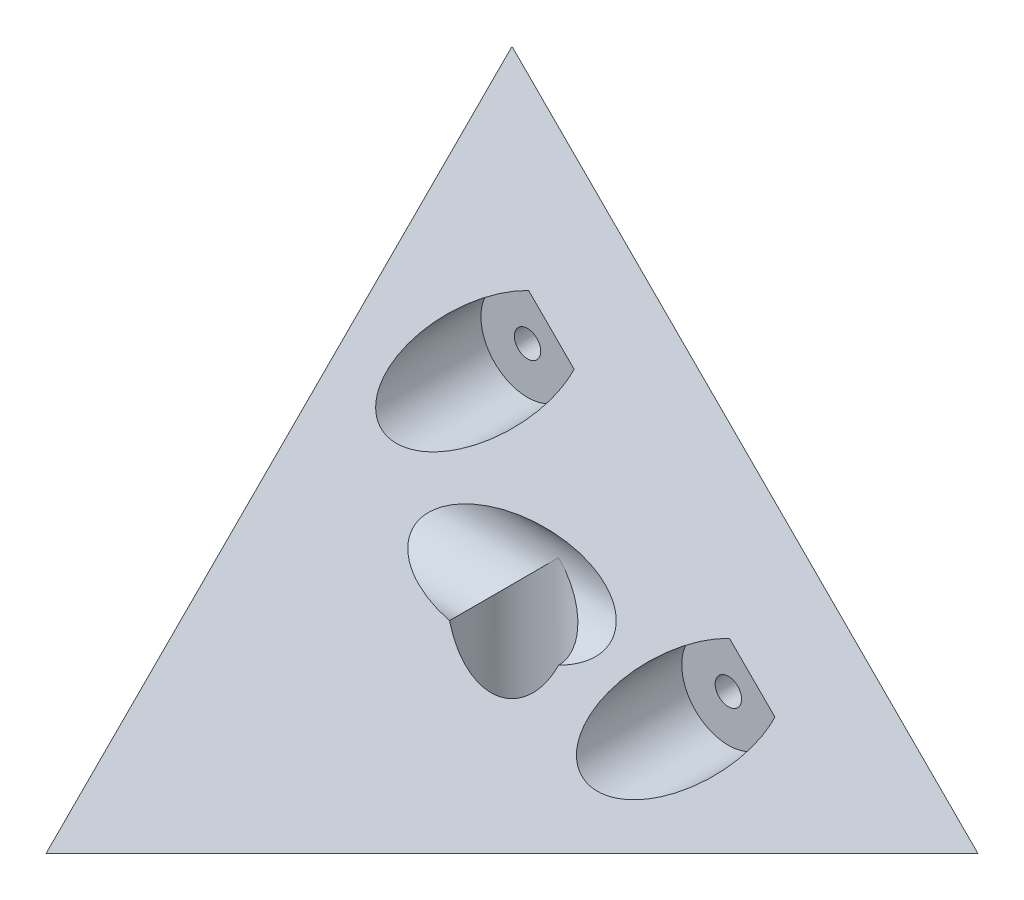
ISO-10303-21;
HEADER;
FILE_DESCRIPTION(('STEP AP214'),'2;1');
FILE_NAME('part.step','',(''),(''),'','','');
FILE_SCHEMA(('AUTOMOTIVE_DESIGN { 1 0 10303 214 1 1 1 1 }'));
ENDSEC;
DATA;
#1=APPLICATION_CONTEXT('core data for automotive mechanical design processes');
#2=APPLICATION_PROTOCOL_DEFINITION('international standard','automotive_design',2000,#1);
#3=PRODUCT_CONTEXT('',#1,'mechanical');
#4=PRODUCT('Part','Part','',(#3));
#5=PRODUCT_RELATED_PRODUCT_CATEGORY('part','',(#4));
#6=PRODUCT_DEFINITION_FORMATION('','',#4);
#7=PRODUCT_DEFINITION_CONTEXT('part definition',#1,'design');
#8=PRODUCT_DEFINITION('design','',#6,#7);
#9=PRODUCT_DEFINITION_SHAPE('','',#8);
#10=(LENGTH_UNIT() NAMED_UNIT(*) SI_UNIT(.MILLI.,.METRE.));
#11=(NAMED_UNIT(*) PLANE_ANGLE_UNIT() SI_UNIT($,.RADIAN.));
#12=(NAMED_UNIT(*) SI_UNIT($,.STERADIAN.) SOLID_ANGLE_UNIT());
#13=UNCERTAINTY_MEASURE_WITH_UNIT(LENGTH_MEASURE(1.E-05),#10,'distance_accuracy_value','');
#14=(GEOMETRIC_REPRESENTATION_CONTEXT(3) GLOBAL_UNCERTAINTY_ASSIGNED_CONTEXT((#13)) GLOBAL_UNIT_ASSIGNED_CONTEXT((#10,
#11,#12)) REPRESENTATION_CONTEXT('',''));
#15=CARTESIAN_POINT('',(0.,0.,0.));
#16=DIRECTION('',(0.,0.,1.));
#17=DIRECTION('',(1.,0.,0.));
#18=AXIS2_PLACEMENT_3D('',#15,#16,#17);
#19=CARTESIAN_POINT('',(0.,0.,0.));
#20=DIRECTION('',(0.,0.,-1.));
#21=DIRECTION('',(-1.,0.,0.));
#22=AXIS2_PLACEMENT_3D('',#19,#20,#21);
#23=PLANE('',#22);
#24=CARTESIAN_POINT('',(5.,17.9289321881345,0.));
#25=DIRECTION('',(0.,0.,1.));
#26=DIRECTION('',(1.,0.,0.));
#27=AXIS2_PLACEMENT_3D('',#24,#25,#26);
#28=CIRCLE('',#27,0.85);
#29=CARTESIAN_POINT('',(5.85,17.9289321881345,0.));
#30=VERTEX_POINT('',#29);
#31=EDGE_CURVE('E135',#30,#30,#28,.T.);
#32=ORIENTED_EDGE('',*,*,#31,.T.);
#33=EDGE_LOOP('',(#32));
#34=FACE_BOUND('',#33,.T.);
#35=DIRECTION('',(0.,-1.,0.));
#36=VECTOR('',#35,1.);
#37=CARTESIAN_POINT('',(0.,0.,0.));
#38=LINE('',#37,#36);
#39=CARTESIAN_POINT('',(0.,30.,0.));
#40=VERTEX_POINT('',#39);
#41=CARTESIAN_POINT('',(0.,0.,0.));
#42=VERTEX_POINT('',#41);
#43=EDGE_CURVE('E139',#40,#42,#38,.T.);
#44=ORIENTED_EDGE('',*,*,#43,.F.);
#45=DIRECTION('',(-0.707106781186548,0.707106781186548,0.));
#46=VECTOR('',#45,1.);
#47=CARTESIAN_POINT('',(15.,15.,0.));
#48=LINE('',#47,#46);
#49=CARTESIAN_POINT('',(30.,0.,0.));
#50=VERTEX_POINT('',#49);
#51=EDGE_CURVE('E41',#40,#50,#48,.F.);
#52=ORIENTED_EDGE('',*,*,#51,.T.);
#53=DIRECTION('',(1.,0.,0.));
#54=VECTOR('',#53,1.);
#55=CARTESIAN_POINT('',(0.,0.,0.));
#56=LINE('',#55,#54);
#57=EDGE_CURVE('E142',#42,#50,#56,.T.);
#58=ORIENTED_EDGE('',*,*,#57,.F.);
#59=EDGE_LOOP('',(#44,#52,#58));
#60=FACE_BOUND('',#59,.T.);
#61=CARTESIAN_POINT('',(17.9289321881345,5.,0.));
#62=DIRECTION('',(0.,0.,1.));
#63=DIRECTION('',(1.,0.,0.));
#64=AXIS2_PLACEMENT_3D('',#61,#62,#63);
#65=CIRCLE('',#64,0.85);
#66=CARTESIAN_POINT('',(18.7789321881345,5.,0.));
#67=VERTEX_POINT('',#66);
#68=EDGE_CURVE('E132',#67,#67,#65,.T.);
#69=ORIENTED_EDGE('',*,*,#68,.T.);
#70=EDGE_LOOP('',(#69));
#71=FACE_BOUND('',#70,.T.);
#72=DIRECTION('',(-1.,0.,0.));
#73=VECTOR('',#72,1.);
#74=CARTESIAN_POINT('',(11.,2.5,0.));
#75=LINE('',#74,#73);
#76=CARTESIAN_POINT('',(11.,2.5,0.));
#77=VERTEX_POINT('',#76);
#78=CARTESIAN_POINT('',(5.,2.5,0.));
#79=VERTEX_POINT('',#78);
#80=EDGE_CURVE('E81',#77,#79,#75,.T.);
#81=ORIENTED_EDGE('',*,*,#80,.F.);
#82=CARTESIAN_POINT('',(11.,5.,0.));
#83=DIRECTION('',(0.,0.,-1.));
#84=DIRECTION('',(-1.,0.,0.));
#85=AXIS2_PLACEMENT_3D('',#82,#83,#84);
#86=CIRCLE('',#85,2.5);
#87=CARTESIAN_POINT('',(11.,7.5,0.));
#88=VERTEX_POINT('',#87);
#89=EDGE_CURVE('E161',#88,#77,#86,.T.);
#90=ORIENTED_EDGE('',*,*,#89,.F.);
#91=DIRECTION('',(1.,0.,0.));
#92=VECTOR('',#91,1.);
#93=CARTESIAN_POINT('',(11.,7.5,0.));
#94=LINE('',#93,#92);
#95=CARTESIAN_POINT('',(5.,7.5,0.));
#96=VERTEX_POINT('',#95);
#97=EDGE_CURVE('E169',#96,#88,#94,.T.);
#98=ORIENTED_EDGE('',*,*,#97,.F.);
#99=CARTESIAN_POINT('',(5.,5.,0.));
#100=DIRECTION('',(0.,0.,-1.));
#101=DIRECTION('',(-1.,0.,0.));
#102=AXIS2_PLACEMENT_3D('',#99,#100,#101);
#103=CIRCLE('',#102,2.5);
#104=EDGE_CURVE('E163',#79,#96,#103,.T.);
#105=ORIENTED_EDGE('',*,*,#104,.F.);
#106=EDGE_LOOP('',(#81,#90,#98,#105));
#107=FACE_BOUND('',#106,.T.);
#108=ADVANCED_FACE('F32',(#34,#60,#71,#107),#23,.T.);
#109=CARTESIAN_POINT('',(0.,0.,30.));
#110=DIRECTION('',(1.,0.,0.));
#111=DIRECTION('',(0.,0.,-1.));
#112=AXIS2_PLACEMENT_3D('',#109,#110,#111);
#113=PLANE('',#112);
#114=CARTESIAN_POINT('',(0.,10.,10.));
#115=DIRECTION('',(-1.,0.,0.));
#116=DIRECTION('',(0.,0.,1.));
#117=AXIS2_PLACEMENT_3D('',#114,#115,#116);
#118=CIRCLE('',#117,3.);
#119=CARTESIAN_POINT('',(0.,10.,13.));
#120=VERTEX_POINT('',#119);
#121=EDGE_CURVE('E120',#120,#120,#118,.T.);
#122=ORIENTED_EDGE('',*,*,#121,.F.);
#123=EDGE_LOOP('',(#122));
#124=FACE_BOUND('',#123,.T.);
#125=DIRECTION('',(0.,0.,-1.));
#126=VECTOR('',#125,1.);
#127=CARTESIAN_POINT('',(0.,0.,30.));
#128=LINE('',#127,#126);
#129=CARTESIAN_POINT('',(0.,0.,30.));
#130=VERTEX_POINT('',#129);
#131=EDGE_CURVE('E145',#130,#42,#128,.T.);
#132=ORIENTED_EDGE('',*,*,#131,.F.);
#133=DIRECTION('',(0.,-0.707106781186546,0.707106781186549));
#134=VECTOR('',#133,1.);
#135=CARTESIAN_POINT('',(0.,0.,30.));
#136=LINE('',#135,#134);
#137=EDGE_CURVE('E11',#130,#40,#136,.F.);
#138=ORIENTED_EDGE('',*,*,#137,.T.);
#139=ORIENTED_EDGE('',*,*,#43,.T.);
#140=EDGE_LOOP('',(#132,#138,#139));
#141=FACE_BOUND('',#140,.T.);
#142=ADVANCED_FACE('F211',(#124,#141),#113,.F.);
#143=CARTESIAN_POINT('',(0.,0.,30.));
#144=DIRECTION('',(0.,1.,0.));
#145=DIRECTION('',(0.,0.,1.));
#146=AXIS2_PLACEMENT_3D('',#143,#144,#145);
#147=PLANE('',#146);
#148=CARTESIAN_POINT('',(10.,0.,10.));
#149=DIRECTION('',(0.,-1.,0.));
#150=DIRECTION('',(0.,0.,-1.));
#151=AXIS2_PLACEMENT_3D('',#148,#149,#150);
#152=CIRCLE('',#151,3.);
#153=CARTESIAN_POINT('',(10.,0.,7.));
#154=VERTEX_POINT('',#153);
#155=EDGE_CURVE('E230',#154,#154,#152,.T.);
#156=ORIENTED_EDGE('',*,*,#155,.F.);
#157=EDGE_LOOP('',(#156));
#158=FACE_BOUND('',#157,.T.);
#159=ORIENTED_EDGE('',*,*,#57,.T.);
#160=DIRECTION('',(0.707106781186546,0.,-0.707106781186549));
#161=VECTOR('',#160,1.);
#162=CARTESIAN_POINT('',(0.,0.,30.));
#163=LINE('',#162,#161);
#164=EDGE_CURVE('E148',#50,#130,#163,.F.);
#165=ORIENTED_EDGE('',*,*,#164,.T.);
#166=ORIENTED_EDGE('',*,*,#131,.T.);
#167=EDGE_LOOP('',(#159,#165,#166));
#168=FACE_BOUND('',#167,.T.);
#169=ADVANCED_FACE('F217',(#158,#168),#147,.F.);
#170=CARTESIAN_POINT('',(5.,17.9289321881345,30.));
#171=DIRECTION('',(0.,0.,-1.));
#172=DIRECTION('',(-1.,0.,0.));
#173=AXIS2_PLACEMENT_3D('',#170,#171,#172);
#174=CYLINDRICAL_SURFACE('',#173,0.85);
#175=CARTESIAN_POINT('',(5.,17.9289321881345,4.));
#176=DIRECTION('',(0.,0.,-1.));
#177=DIRECTION('',(-1.,0.,0.));
#178=AXIS2_PLACEMENT_3D('',#175,#176,#177);
#179=CIRCLE('',#178,0.85);
#180=CARTESIAN_POINT('',(4.15,17.9289321881345,4.));
#181=VERTEX_POINT('',#180);
#182=EDGE_CURVE('E127',#181,#181,#179,.F.);
#183=ORIENTED_EDGE('',*,*,#182,.T.);
#184=EDGE_LOOP('',(#183));
#185=FACE_BOUND('',#184,.T.);
#186=ORIENTED_EDGE('',*,*,#31,.F.);
#187=EDGE_LOOP('',(#186));
#188=FACE_BOUND('',#187,.T.);
#189=ADVANCED_FACE('F184',(#185,#188),#174,.F.);
#190=CARTESIAN_POINT('',(17.9289321881345,5.,30.));
#191=DIRECTION('',(0.,0.,-1.));
#192=DIRECTION('',(-1.,0.,0.));
#193=AXIS2_PLACEMENT_3D('',#190,#191,#192);
#194=CYLINDRICAL_SURFACE('',#193,0.85);
#195=CARTESIAN_POINT('',(17.9289321881345,5.,4.));
#196=DIRECTION('',(0.,0.,-1.));
#197=DIRECTION('',(-1.,0.,0.));
#198=AXIS2_PLACEMENT_3D('',#195,#196,#197);
#199=CIRCLE('',#198,0.85);
#200=CARTESIAN_POINT('',(17.0789321881345,5.,4.));
#201=VERTEX_POINT('',#200);
#202=EDGE_CURVE('E115',#201,#201,#199,.F.);
#203=ORIENTED_EDGE('',*,*,#202,.T.);
#204=EDGE_LOOP('',(#203));
#205=FACE_BOUND('',#204,.T.);
#206=ORIENTED_EDGE('',*,*,#68,.F.);
#207=EDGE_LOOP('',(#206));
#208=FACE_BOUND('',#207,.T.);
#209=ADVANCED_FACE('F197',(#205,#208),#194,.F.);
#210=CARTESIAN_POINT('',(0.,0.,30.));
#211=DIRECTION('',(0.577350269189626,0.577350269189626,0.577350269189625));
#212=DIRECTION('',(-0.707106781186547,0.707106781186547,0.));
#213=AXIS2_PLACEMENT_3D('',#210,#211,#212);
#214=PLANE('',#213);
#215=CARTESIAN_POINT('',(10.,9.99999999999994,10.));
#216=DIRECTION('',(0.577350269189626,0.577350269189626,0.577350269189625));
#217=DIRECTION('',(0.408248290463864,-0.816496580927726,0.408248290463863));
#218=AXIS2_PLACEMENT_3D('',#215,#216,#217);
#219=ELLIPSE('',#218,5.19615242270663,3.);
#220=CARTESIAN_POINT('',(13.,7.,9.99999999999993));
#221=VERTEX_POINT('',#220);
#222=CARTESIAN_POINT('',(8.6583592135001,8.6583592135001,12.6832815729997));
#223=VERTEX_POINT('',#222);
#224=EDGE_CURVE('E242',#221,#223,#219,.F.);
#225=ORIENTED_EDGE('',*,*,#224,.T.);
#226=CARTESIAN_POINT('',(9.99999999999994,10.,10.));
#227=DIRECTION('',(0.577350269189626,0.577350269189626,0.577350269189625));
#228=DIRECTION('',(-0.816496580927726,0.408248290463864,0.408248290463863));
#229=AXIS2_PLACEMENT_3D('',#226,#227,#228);
#230=ELLIPSE('',#229,5.19615242270663,3.);
#231=EDGE_CURVE('E171',#223,#221,#230,.F.);
#232=ORIENTED_EDGE('',*,*,#231,.T.);
#233=EDGE_LOOP('',(#225,#232));
#234=FACE_BOUND('',#233,.T.);
#235=CARTESIAN_POINT('',(5.,17.9289321881345,7.07106781186541));
#236=DIRECTION('',(0.577350269189626,0.577350269189626,0.577350269189625));
#237=DIRECTION('',(0.408248290463862,0.408248290463862,-0.816496580927727));
#238=AXIS2_PLACEMENT_3D('',#235,#236,#237);
#239=ELLIPSE('',#238,5.19615242270664,3.);
#240=CARTESIAN_POINT('',(7.99913754890817,18.0008624510917,4.));
#241=VERTEX_POINT('',#240);
#242=CARTESIAN_POINT('',(5.07193026295723,20.9280697370427,4.));
#243=VERTEX_POINT('',#242);
#244=EDGE_CURVE('E124',#241,#243,#239,.F.);
#245=ORIENTED_EDGE('',*,*,#244,.T.);
#246=DIRECTION('',(0.707106781186547,-0.707106781186547,0.));
#247=VECTOR('',#246,1.);
#248=CARTESIAN_POINT('',(6.5355339059327,19.4644660940672,4.));
#249=LINE('',#248,#247);
#250=EDGE_CURVE('E136',#243,#241,#249,.T.);
#251=ORIENTED_EDGE('',*,*,#250,.T.);
#252=EDGE_LOOP('',(#245,#251));
#253=FACE_BOUND('',#252,.T.);
#254=CARTESIAN_POINT('',(17.9289321881345,5.,7.07106781186541));
#255=DIRECTION('',(0.577350269189626,0.577350269189626,0.577350269189625));
#256=DIRECTION('',(0.408248290463862,0.408248290463862,-0.816496580927727));
#257=AXIS2_PLACEMENT_3D('',#254,#255,#256);
#258=ELLIPSE('',#257,5.19615242270664,3.);
#259=CARTESIAN_POINT('',(20.9280697370427,5.07193026295723,4.));
#260=VERTEX_POINT('',#259);
#261=CARTESIAN_POINT('',(18.0008624510918,7.99913754890817,4.));
#262=VERTEX_POINT('',#261);
#263=EDGE_CURVE('E117',#260,#262,#258,.F.);
#264=ORIENTED_EDGE('',*,*,#263,.T.);
#265=DIRECTION('',(0.707106781186547,-0.707106781186547,0.));
#266=VECTOR('',#265,1.);
#267=CARTESIAN_POINT('',(19.4644660940672,6.5355339059327,4.));
#268=LINE('',#267,#266);
#269=EDGE_CURVE('E112',#262,#260,#268,.T.);
#270=ORIENTED_EDGE('',*,*,#269,.T.);
#271=EDGE_LOOP('',(#264,#270));
#272=FACE_BOUND('',#271,.T.);
#273=ORIENTED_EDGE('',*,*,#51,.F.);
#274=ORIENTED_EDGE('',*,*,#137,.F.);
#275=ORIENTED_EDGE('',*,*,#164,.F.);
#276=EDGE_LOOP('',(#273,#274,#275));
#277=FACE_BOUND('',#276,.T.);
#278=ADVANCED_FACE('F122',(#234,#253,#272,#277),#214,.T.);
#279=CARTESIAN_POINT('',(17.9289321881345,5.,30.001));
#280=DIRECTION('',(0.,0.,-1.));
#281=DIRECTION('',(-1.,0.,0.));
#282=AXIS2_PLACEMENT_3D('',#279,#280,#281);
#283=CYLINDRICAL_SURFACE('',#282,3.);
#284=CARTESIAN_POINT('',(17.9289321881345,5.,4.));
#285=DIRECTION('',(0.,0.,-1.));
#286=DIRECTION('',(-1.,0.,0.));
#287=AXIS2_PLACEMENT_3D('',#284,#285,#286);
#288=CIRCLE('',#287,3.);
#289=EDGE_CURVE('E108',#260,#262,#288,.T.);
#290=ORIENTED_EDGE('',*,*,#289,.T.);
#291=ORIENTED_EDGE('',*,*,#263,.F.);
#292=EDGE_LOOP('',(#290,#291));
#293=FACE_BOUND('',#292,.T.);
#294=ADVANCED_FACE('F118',(#293),#283,.F.);
#295=CARTESIAN_POINT('',(17.9289321881345,5.,4.));
#296=DIRECTION('',(0.,0.,-1.));
#297=DIRECTION('',(-1.,0.,0.));
#298=AXIS2_PLACEMENT_3D('',#295,#296,#297);
#299=PLANE('',#298);
#300=ORIENTED_EDGE('',*,*,#202,.F.);
#301=EDGE_LOOP('',(#300));
#302=FACE_BOUND('',#301,.T.);
#303=ORIENTED_EDGE('',*,*,#289,.F.);
#304=ORIENTED_EDGE('',*,*,#269,.F.);
#305=EDGE_LOOP('',(#303,#304));
#306=FACE_BOUND('',#305,.T.);
#307=ADVANCED_FACE('F110',(#302,#306),#299,.F.);
#308=CARTESIAN_POINT('',(5.,17.9289321881345,30.001));
#309=DIRECTION('',(0.,0.,-1.));
#310=DIRECTION('',(-1.,0.,0.));
#311=AXIS2_PLACEMENT_3D('',#308,#309,#310);
#312=CYLINDRICAL_SURFACE('',#311,3.);
#313=CARTESIAN_POINT('',(5.,17.9289321881345,4.));
#314=DIRECTION('',(0.,0.,-1.));
#315=DIRECTION('',(-1.,0.,0.));
#316=AXIS2_PLACEMENT_3D('',#313,#314,#315);
#317=CIRCLE('',#316,3.);
#318=EDGE_CURVE('E176',#241,#243,#317,.T.);
#319=ORIENTED_EDGE('',*,*,#318,.T.);
#320=ORIENTED_EDGE('',*,*,#244,.F.);
#321=EDGE_LOOP('',(#319,#320));
#322=FACE_BOUND('',#321,.T.);
#323=ADVANCED_FACE('F191',(#322),#312,.F.);
#324=CARTESIAN_POINT('',(5.,17.9289321881345,4.));
#325=DIRECTION('',(0.,0.,-1.));
#326=DIRECTION('',(-1.,0.,0.));
#327=AXIS2_PLACEMENT_3D('',#324,#325,#326);
#328=PLANE('',#327);
#329=ORIENTED_EDGE('',*,*,#182,.F.);
#330=EDGE_LOOP('',(#329));
#331=FACE_BOUND('',#330,.T.);
#332=ORIENTED_EDGE('',*,*,#318,.F.);
#333=ORIENTED_EDGE('',*,*,#250,.F.);
#334=EDGE_LOOP('',(#332,#333));
#335=FACE_BOUND('',#334,.T.);
#336=ADVANCED_FACE('F187',(#331,#335),#328,.F.);
#337=CARTESIAN_POINT('',(30.001,10.,10.));
#338=DIRECTION('',(-1.,0.,0.));
#339=DIRECTION('',(0.,0.,1.));
#340=AXIS2_PLACEMENT_3D('',#337,#338,#339);
#341=CYLINDRICAL_SURFACE('',#340,3.);
#342=CARTESIAN_POINT('',(10.,10.,10.));
#343=DIRECTION('',(0.707106781186547,-0.707106781186547,0.));
#344=DIRECTION('',(-0.707106781186547,-0.707106781186547,0.));
#345=AXIS2_PLACEMENT_3D('',#342,#343,#344);
#346=ELLIPSE('',#345,4.24264068711929,3.);
#347=CARTESIAN_POINT('',(10.,10.,7.));
#348=VERTEX_POINT('',#347);
#349=EDGE_CURVE('E240',#348,#223,#346,.F.);
#350=ORIENTED_EDGE('',*,*,#349,.F.);
#351=CARTESIAN_POINT('',(10.,10.,10.));
#352=DIRECTION('',(-0.707106781186547,-0.707106781186547,0.));
#353=DIRECTION('',(0.707106781186547,-0.707106781186547,0.));
#354=AXIS2_PLACEMENT_3D('',#351,#352,#353);
#355=ELLIPSE('',#354,4.24264068711929,3.);
#356=EDGE_CURVE('E49',#221,#348,#355,.F.);
#357=ORIENTED_EDGE('',*,*,#356,.F.);
#358=ORIENTED_EDGE('',*,*,#231,.F.);
#359=EDGE_LOOP('',(#350,#357,#358));
#360=FACE_BOUND('',#359,.T.);
#361=ORIENTED_EDGE('',*,*,#121,.T.);
#362=EDGE_LOOP('',(#361));
#363=FACE_BOUND('',#362,.T.);
#364=ADVANCED_FACE('F190',(#360,#363),#341,.F.);
#365=CARTESIAN_POINT('',(5.,5.,0.));
#366=DIRECTION('',(0.,0.,-1.));
#367=DIRECTION('',(-1.,0.,0.));
#368=AXIS2_PLACEMENT_3D('',#365,#366,#367);
#369=SPHERICAL_SURFACE('',#368,2.5);
#370=CARTESIAN_POINT('',(5.,5.,0.));
#371=DIRECTION('',(1.,0.,0.));
#372=DIRECTION('',(0.,1.,0.));
#373=AXIS2_PLACEMENT_3D('',#370,#371,#372);
#374=CIRCLE('',#373,2.5);
#375=CARTESIAN_POINT('',(5.,5.,-2.5));
#376=VERTEX_POINT('',#375);
#377=EDGE_CURVE('E36',#79,#376,#374,.T.);
#378=ORIENTED_EDGE('',*,*,#377,.F.);
#379=ORIENTED_EDGE('',*,*,#104,.T.);
#380=CARTESIAN_POINT('',(5.,5.,0.));
#381=DIRECTION('',(1.,0.,0.));
#382=DIRECTION('',(0.,0.,-1.));
#383=AXIS2_PLACEMENT_3D('',#380,#381,#382);
#384=CIRCLE('',#383,2.5);
#385=EDGE_CURVE('E58',#376,#96,#384,.T.);
#386=ORIENTED_EDGE('',*,*,#385,.F.);
#387=EDGE_LOOP('',(#378,#379,#386));
#388=FACE_BOUND('',#387,.T.);
#389=ADVANCED_FACE('F34',(#388),#369,.T.);
#390=CARTESIAN_POINT('',(11.,5.,0.));
#391=DIRECTION('',(1.,0.,0.));
#392=DIRECTION('',(0.,1.,0.));
#393=AXIS2_PLACEMENT_3D('',#390,#391,#392);
#394=CYLINDRICAL_SURFACE('',#393,2.5);
#395=CARTESIAN_POINT('',(11.,5.,0.));
#396=DIRECTION('',(1.,0.,0.));
#397=DIRECTION('',(0.,0.,-1.));
#398=AXIS2_PLACEMENT_3D('',#395,#396,#397);
#399=CIRCLE('',#398,2.5);
#400=CARTESIAN_POINT('',(11.,5.,-2.5));
#401=VERTEX_POINT('',#400);
#402=EDGE_CURVE('E157',#77,#401,#399,.T.);
#403=ORIENTED_EDGE('',*,*,#402,.F.);
#404=ORIENTED_EDGE('',*,*,#80,.T.);
#405=ORIENTED_EDGE('',*,*,#377,.T.);
#406=DIRECTION('',(-1.,0.,0.));
#407=VECTOR('',#406,1.);
#408=CARTESIAN_POINT('',(5.,5.,-2.5));
#409=LINE('',#408,#407);
#410=EDGE_CURVE('E155',#401,#376,#409,.T.);
#411=ORIENTED_EDGE('',*,*,#410,.F.);
#412=EDGE_LOOP('',(#403,#404,#405,#411));
#413=FACE_BOUND('',#412,.T.);
#414=ADVANCED_FACE('F287',(#413),#394,.T.);
#415=CARTESIAN_POINT('',(11.,5.,0.));
#416=DIRECTION('',(0.,0.,-1.));
#417=DIRECTION('',(-1.,0.,0.));
#418=AXIS2_PLACEMENT_3D('',#415,#416,#417);
#419=SPHERICAL_SURFACE('',#418,2.5);
#420=ORIENTED_EDGE('',*,*,#89,.T.);
#421=ORIENTED_EDGE('',*,*,#402,.T.);
#422=CARTESIAN_POINT('',(11.,5.,0.));
#423=DIRECTION('',(-1.,0.,0.));
#424=DIRECTION('',(0.,-1.,0.));
#425=AXIS2_PLACEMENT_3D('',#422,#423,#424);
#426=CIRCLE('',#425,2.5);
#427=EDGE_CURVE('E152',#88,#401,#426,.T.);
#428=ORIENTED_EDGE('',*,*,#427,.F.);
#429=EDGE_LOOP('',(#420,#421,#428));
#430=FACE_BOUND('',#429,.T.);
#431=ADVANCED_FACE('F255',(#430),#419,.T.);
#432=CARTESIAN_POINT('',(11.,5.,0.));
#433=DIRECTION('',(-1.,0.,0.));
#434=DIRECTION('',(0.,0.,1.));
#435=AXIS2_PLACEMENT_3D('',#432,#433,#434);
#436=CYLINDRICAL_SURFACE('',#435,2.5);
#437=ORIENTED_EDGE('',*,*,#385,.T.);
#438=ORIENTED_EDGE('',*,*,#97,.T.);
#439=ORIENTED_EDGE('',*,*,#427,.T.);
#440=ORIENTED_EDGE('',*,*,#410,.T.);
#441=EDGE_LOOP('',(#437,#438,#439,#440));
#442=FACE_BOUND('',#441,.T.);
#443=ADVANCED_FACE('F250',(#442),#436,.T.);
#444=CARTESIAN_POINT('',(10.,30.001,10.));
#445=DIRECTION('',(0.,-1.,0.));
#446=DIRECTION('',(0.,0.,-1.));
#447=AXIS2_PLACEMENT_3D('',#444,#445,#446);
#448=CYLINDRICAL_SURFACE('',#447,3.);
#449=ORIENTED_EDGE('',*,*,#155,.T.);
#450=EDGE_LOOP('',(#449));
#451=FACE_BOUND('',#450,.T.);
#452=ORIENTED_EDGE('',*,*,#356,.T.);
#453=ORIENTED_EDGE('',*,*,#349,.T.);
#454=ORIENTED_EDGE('',*,*,#224,.F.);
#455=EDGE_LOOP('',(#452,#453,#454));
#456=FACE_BOUND('',#455,.T.);
#457=ADVANCED_FACE('F248',(#451,#456),#448,.F.);
#458=CLOSED_SHELL('',(#108,#142,#169,#189,#209,#278,#294,#307,#323,#336,#364,#389,#414,#431,
#443,#457));
#459=MANIFOLD_SOLID_BREP('B2',#458);
#460=ADVANCED_BREP_SHAPE_REPRESENTATION('',(#18,#459),#14);
#461=SHAPE_DEFINITION_REPRESENTATION(#9,#460);
ENDSEC;
END-ISO-10303-21;
